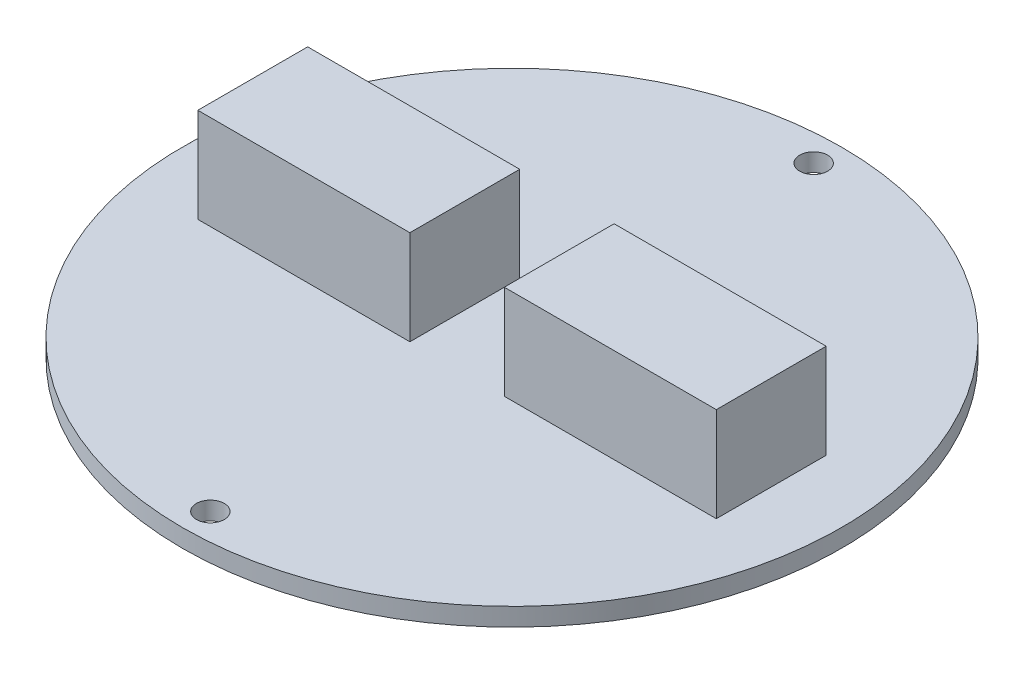
ISO-10303-21;
HEADER;
FILE_DESCRIPTION(('STEP AP214'),'2;1');
FILE_NAME('part.step','',(''),(''),'','','');
FILE_SCHEMA(('AUTOMOTIVE_DESIGN { 1 0 10303 214 1 1 1 1 }'));
ENDSEC;
DATA;
#1=APPLICATION_CONTEXT('core data for automotive mechanical design processes');
#2=APPLICATION_PROTOCOL_DEFINITION('international standard','automotive_design',2000,#1);
#3=PRODUCT_CONTEXT('',#1,'mechanical');
#4=PRODUCT('Part','Part','',(#3));
#5=PRODUCT_RELATED_PRODUCT_CATEGORY('part','',(#4));
#6=PRODUCT_DEFINITION_FORMATION('','',#4);
#7=PRODUCT_DEFINITION_CONTEXT('part definition',#1,'design');
#8=PRODUCT_DEFINITION('design','',#6,#7);
#9=PRODUCT_DEFINITION_SHAPE('','',#8);
#10=(LENGTH_UNIT() NAMED_UNIT(*) SI_UNIT(.MILLI.,.METRE.));
#11=(NAMED_UNIT(*) PLANE_ANGLE_UNIT() SI_UNIT($,.RADIAN.));
#12=(NAMED_UNIT(*) SI_UNIT($,.STERADIAN.) SOLID_ANGLE_UNIT());
#13=UNCERTAINTY_MEASURE_WITH_UNIT(LENGTH_MEASURE(1.E-05),#10,'distance_accuracy_value','');
#14=(GEOMETRIC_REPRESENTATION_CONTEXT(3) GLOBAL_UNCERTAINTY_ASSIGNED_CONTEXT((#13)) GLOBAL_UNIT_ASSIGNED_CONTEXT((#10,
#11,#12)) REPRESENTATION_CONTEXT('',''));
#15=CARTESIAN_POINT('',(0.,0.,0.));
#16=DIRECTION('',(0.,0.,1.));
#17=DIRECTION('',(1.,0.,0.));
#18=AXIS2_PLACEMENT_3D('',#15,#16,#17);
#19=CARTESIAN_POINT('',(0.,1.64,0.));
#20=DIRECTION('',(0.,1.,0.));
#21=DIRECTION('',(0.,0.,1.));
#22=AXIS2_PLACEMENT_3D('',#19,#20,#21);
#23=PLANE('',#22);
#24=DIRECTION('',(-1.,0.,0.));
#25=VECTOR('',#24,1.);
#26=CARTESIAN_POINT('',(-23.6,1.64,-5.));
#27=LINE('',#26,#25);
#28=CARTESIAN_POINT('',(-4.296,1.64,-5.));
#29=VERTEX_POINT('',#28);
#30=CARTESIAN_POINT('',(-23.6,1.64,-5.));
#31=VERTEX_POINT('',#30);
#32=EDGE_CURVE('E126',#29,#31,#27,.T.);
#33=ORIENTED_EDGE('',*,*,#32,.F.);
#34=DIRECTION('',(0.,0.,-1.));
#35=VECTOR('',#34,1.);
#36=CARTESIAN_POINT('',(-4.296,1.64,5.));
#37=LINE('',#36,#35);
#38=CARTESIAN_POINT('',(-4.296,1.64,5.));
#39=VERTEX_POINT('',#38);
#40=EDGE_CURVE('E123',#39,#29,#37,.T.);
#41=ORIENTED_EDGE('',*,*,#40,.F.);
#42=DIRECTION('',(1.,0.,0.));
#43=VECTOR('',#42,1.);
#44=CARTESIAN_POINT('',(-23.6,1.64,5.));
#45=LINE('',#44,#43);
#46=CARTESIAN_POINT('',(-23.6,1.64,5.));
#47=VERTEX_POINT('',#46);
#48=EDGE_CURVE('E135',#47,#39,#45,.T.);
#49=ORIENTED_EDGE('',*,*,#48,.F.);
#50=DIRECTION('',(0.,0.,1.));
#51=VECTOR('',#50,1.);
#52=CARTESIAN_POINT('',(-23.6,1.64,5.));
#53=LINE('',#52,#51);
#54=EDGE_CURVE('E143',#31,#47,#53,.T.);
#55=ORIENTED_EDGE('',*,*,#54,.F.);
#56=EDGE_LOOP('',(#33,#41,#49,#55));
#57=FACE_BOUND('',#56,.T.);
#58=CARTESIAN_POINT('',(0.,1.64,27.46));
#59=DIRECTION('',(0.,1.,0.));
#60=DIRECTION('',(0.,0.,1.));
#61=AXIS2_PLACEMENT_3D('',#58,#59,#60);
#62=CIRCLE('',#61,1.27);
#63=CARTESIAN_POINT('',(0.,1.64,28.73));
#64=VERTEX_POINT('',#63);
#65=EDGE_CURVE('E154',#64,#64,#62,.T.);
#66=ORIENTED_EDGE('',*,*,#65,.F.);
#67=EDGE_LOOP('',(#66));
#68=FACE_BOUND('',#67,.T.);
#69=CARTESIAN_POINT('',(0.,1.64,-27.46));
#70=DIRECTION('',(0.,1.,0.));
#71=DIRECTION('',(0.,0.,1.));
#72=AXIS2_PLACEMENT_3D('',#69,#70,#71);
#73=CIRCLE('',#72,1.27);
#74=CARTESIAN_POINT('',(0.,1.64,-26.19));
#75=VERTEX_POINT('',#74);
#76=EDGE_CURVE('E158',#75,#75,#73,.T.);
#77=ORIENTED_EDGE('',*,*,#76,.F.);
#78=EDGE_LOOP('',(#77));
#79=FACE_BOUND('',#78,.T.);
#80=CARTESIAN_POINT('',(0.,1.64,0.));
#81=DIRECTION('',(0.,1.,0.));
#82=DIRECTION('',(0.,0.,1.));
#83=AXIS2_PLACEMENT_3D('',#80,#81,#82);
#84=CIRCLE('',#83,30.);
#85=CARTESIAN_POINT('',(0.,1.64,30.));
#86=VERTEX_POINT('',#85);
#87=EDGE_CURVE('E11',#86,#86,#84,.T.);
#88=ORIENTED_EDGE('',*,*,#87,.T.);
#89=EDGE_LOOP('',(#88));
#90=FACE_BOUND('',#89,.T.);
#91=DIRECTION('',(-1.,0.,0.));
#92=VECTOR('',#91,1.);
#93=CARTESIAN_POINT('',(4.296,1.64,-5.));
#94=LINE('',#93,#92);
#95=CARTESIAN_POINT('',(23.6,1.64,-5.));
#96=VERTEX_POINT('',#95);
#97=CARTESIAN_POINT('',(4.296,1.64,-5.));
#98=VERTEX_POINT('',#97);
#99=EDGE_CURVE('E176',#96,#98,#94,.T.);
#100=ORIENTED_EDGE('',*,*,#99,.F.);
#101=DIRECTION('',(0.,0.,-1.));
#102=VECTOR('',#101,1.);
#103=CARTESIAN_POINT('',(23.6,1.64,5.));
#104=LINE('',#103,#102);
#105=CARTESIAN_POINT('',(23.6,1.64,5.));
#106=VERTEX_POINT('',#105);
#107=EDGE_CURVE('E121',#106,#96,#104,.T.);
#108=ORIENTED_EDGE('',*,*,#107,.F.);
#109=DIRECTION('',(1.,0.,0.));
#110=VECTOR('',#109,1.);
#111=CARTESIAN_POINT('',(4.296,1.64,5.));
#112=LINE('',#111,#110);
#113=CARTESIAN_POINT('',(4.296,1.64,5.));
#114=VERTEX_POINT('',#113);
#115=EDGE_CURVE('E117',#114,#106,#112,.T.);
#116=ORIENTED_EDGE('',*,*,#115,.F.);
#117=DIRECTION('',(0.,0.,1.));
#118=VECTOR('',#117,1.);
#119=CARTESIAN_POINT('',(4.296,1.64,5.));
#120=LINE('',#119,#118);
#121=EDGE_CURVE('E178',#98,#114,#120,.T.);
#122=ORIENTED_EDGE('',*,*,#121,.F.);
#123=EDGE_LOOP('',(#100,#108,#116,#122));
#124=FACE_BOUND('',#123,.T.);
#125=ADVANCED_FACE('F32',(#57,#68,#79,#90,#124),#23,.T.);
#126=CARTESIAN_POINT('',(0.,1.64,0.));
#127=DIRECTION('',(0.,-1.,0.));
#128=DIRECTION('',(0.,0.,-1.));
#129=AXIS2_PLACEMENT_3D('',#126,#127,#128);
#130=CYLINDRICAL_SURFACE('',#129,30.);
#131=ORIENTED_EDGE('',*,*,#87,.F.);
#132=EDGE_LOOP('',(#131));
#133=FACE_BOUND('',#132,.T.);
#134=CARTESIAN_POINT('',(0.,0.,0.));
#135=DIRECTION('',(0.,1.,0.));
#136=DIRECTION('',(0.,0.,1.));
#137=AXIS2_PLACEMENT_3D('',#134,#135,#136);
#138=CIRCLE('',#137,30.);
#139=CARTESIAN_POINT('',(0.,0.,30.));
#140=VERTEX_POINT('',#139);
#141=EDGE_CURVE('E36',#140,#140,#138,.T.);
#142=ORIENTED_EDGE('',*,*,#141,.T.);
#143=EDGE_LOOP('',(#142));
#144=FACE_BOUND('',#143,.T.);
#145=ADVANCED_FACE('F34',(#133,#144),#130,.T.);
#146=CARTESIAN_POINT('',(0.,0.,0.));
#147=DIRECTION('',(0.,1.,0.));
#148=DIRECTION('',(0.,0.,1.));
#149=AXIS2_PLACEMENT_3D('',#146,#147,#148);
#150=PLANE('',#149);
#151=CARTESIAN_POINT('',(0.,0.,27.46));
#152=DIRECTION('',(0.,1.,0.));
#153=DIRECTION('',(0.,0.,1.));
#154=AXIS2_PLACEMENT_3D('',#151,#152,#153);
#155=CIRCLE('',#154,1.27);
#156=CARTESIAN_POINT('',(0.,0.,28.73));
#157=VERTEX_POINT('',#156);
#158=EDGE_CURVE('E155',#157,#157,#155,.T.);
#159=ORIENTED_EDGE('',*,*,#158,.T.);
#160=EDGE_LOOP('',(#159));
#161=FACE_BOUND('',#160,.T.);
#162=CARTESIAN_POINT('',(0.,0.,-27.46));
#163=DIRECTION('',(0.,1.,0.));
#164=DIRECTION('',(0.,0.,1.));
#165=AXIS2_PLACEMENT_3D('',#162,#163,#164);
#166=CIRCLE('',#165,1.27);
#167=CARTESIAN_POINT('',(0.,0.,-26.19));
#168=VERTEX_POINT('',#167);
#169=EDGE_CURVE('E161',#168,#168,#166,.T.);
#170=ORIENTED_EDGE('',*,*,#169,.T.);
#171=EDGE_LOOP('',(#170));
#172=FACE_BOUND('',#171,.T.);
#173=ORIENTED_EDGE('',*,*,#141,.F.);
#174=EDGE_LOOP('',(#173));
#175=FACE_BOUND('',#174,.T.);
#176=ADVANCED_FACE('F227',(#161,#172,#175),#150,.F.);
#177=CARTESIAN_POINT('',(0.,0.,-27.46));
#178=DIRECTION('',(0.,1.,0.));
#179=DIRECTION('',(0.,0.,1.));
#180=AXIS2_PLACEMENT_3D('',#177,#178,#179);
#181=CYLINDRICAL_SURFACE('',#180,1.27);
#182=ORIENTED_EDGE('',*,*,#169,.F.);
#183=EDGE_LOOP('',(#182));
#184=FACE_BOUND('',#183,.T.);
#185=ORIENTED_EDGE('',*,*,#76,.T.);
#186=EDGE_LOOP('',(#185));
#187=FACE_BOUND('',#186,.T.);
#188=ADVANCED_FACE('F167',(#184,#187),#181,.F.);
#189=CARTESIAN_POINT('',(0.,0.,27.46));
#190=DIRECTION('',(0.,1.,0.));
#191=DIRECTION('',(0.,0.,1.));
#192=AXIS2_PLACEMENT_3D('',#189,#190,#191);
#193=CYLINDRICAL_SURFACE('',#192,1.27);
#194=ORIENTED_EDGE('',*,*,#158,.F.);
#195=EDGE_LOOP('',(#194));
#196=FACE_BOUND('',#195,.T.);
#197=ORIENTED_EDGE('',*,*,#65,.T.);
#198=EDGE_LOOP('',(#197));
#199=FACE_BOUND('',#198,.T.);
#200=ADVANCED_FACE('F221',(#196,#199),#193,.F.);
#201=CARTESIAN_POINT('',(-4.296,10.24,5.));
#202=DIRECTION('',(-1.,0.,0.));
#203=DIRECTION('',(0.,0.,1.));
#204=AXIS2_PLACEMENT_3D('',#201,#202,#203);
#205=PLANE('',#204);
#206=ORIENTED_EDGE('',*,*,#40,.T.);
#207=DIRECTION('',(0.,-1.,0.));
#208=VECTOR('',#207,1.);
#209=CARTESIAN_POINT('',(-4.296,10.24,-5.));
#210=LINE('',#209,#208);
#211=CARTESIAN_POINT('',(-4.296,10.24,-5.));
#212=VERTEX_POINT('',#211);
#213=EDGE_CURVE('E152',#212,#29,#210,.T.);
#214=ORIENTED_EDGE('',*,*,#213,.F.);
#215=DIRECTION('',(0.,0.,-1.));
#216=VECTOR('',#215,1.);
#217=CARTESIAN_POINT('',(-4.296,10.24,5.));
#218=LINE('',#217,#216);
#219=CARTESIAN_POINT('',(-4.296,10.24,5.));
#220=VERTEX_POINT('',#219);
#221=EDGE_CURVE('E131',#220,#212,#218,.T.);
#222=ORIENTED_EDGE('',*,*,#221,.F.);
#223=DIRECTION('',(0.,-1.,0.));
#224=VECTOR('',#223,1.);
#225=CARTESIAN_POINT('',(-4.296,10.24,5.));
#226=LINE('',#225,#224);
#227=EDGE_CURVE('E140',#220,#39,#226,.T.);
#228=ORIENTED_EDGE('',*,*,#227,.T.);
#229=EDGE_LOOP('',(#206,#214,#222,#228));
#230=FACE_BOUND('',#229,.T.);
#231=ADVANCED_FACE('F217',(#230),#205,.F.);
#232=CARTESIAN_POINT('',(-23.6,10.24,-5.));
#233=DIRECTION('',(0.,0.,1.));
#234=DIRECTION('',(1.,0.,0.));
#235=AXIS2_PLACEMENT_3D('',#232,#233,#234);
#236=PLANE('',#235);
#237=ORIENTED_EDGE('',*,*,#32,.T.);
#238=DIRECTION('',(0.,-1.,0.));
#239=VECTOR('',#238,1.);
#240=CARTESIAN_POINT('',(-23.6,10.24,-5.));
#241=LINE('',#240,#239);
#242=CARTESIAN_POINT('',(-23.6,10.24,-5.));
#243=VERTEX_POINT('',#242);
#244=EDGE_CURVE('E149',#243,#31,#241,.T.);
#245=ORIENTED_EDGE('',*,*,#244,.F.);
#246=DIRECTION('',(-1.,0.,0.));
#247=VECTOR('',#246,1.);
#248=CARTESIAN_POINT('',(-23.6,10.24,-5.));
#249=LINE('',#248,#247);
#250=EDGE_CURVE('E134',#212,#243,#249,.T.);
#251=ORIENTED_EDGE('',*,*,#250,.F.);
#252=ORIENTED_EDGE('',*,*,#213,.T.);
#253=EDGE_LOOP('',(#237,#245,#251,#252));
#254=FACE_BOUND('',#253,.T.);
#255=ADVANCED_FACE('F213',(#254),#236,.F.);
#256=CARTESIAN_POINT('',(-23.6,10.24,5.));
#257=DIRECTION('',(1.,0.,0.));
#258=DIRECTION('',(0.,0.,-1.));
#259=AXIS2_PLACEMENT_3D('',#256,#257,#258);
#260=PLANE('',#259);
#261=ORIENTED_EDGE('',*,*,#54,.T.);
#262=DIRECTION('',(0.,-1.,0.));
#263=VECTOR('',#262,1.);
#264=CARTESIAN_POINT('',(-23.6,10.24,5.));
#265=LINE('',#264,#263);
#266=CARTESIAN_POINT('',(-23.6,10.24,5.));
#267=VERTEX_POINT('',#266);
#268=EDGE_CURVE('E55',#267,#47,#265,.T.);
#269=ORIENTED_EDGE('',*,*,#268,.F.);
#270=DIRECTION('',(0.,0.,1.));
#271=VECTOR('',#270,1.);
#272=CARTESIAN_POINT('',(-23.6,10.24,5.));
#273=LINE('',#272,#271);
#274=EDGE_CURVE('E137',#243,#267,#273,.T.);
#275=ORIENTED_EDGE('',*,*,#274,.F.);
#276=ORIENTED_EDGE('',*,*,#244,.T.);
#277=EDGE_LOOP('',(#261,#269,#275,#276));
#278=FACE_BOUND('',#277,.T.);
#279=ADVANCED_FACE('F210',(#278),#260,.F.);
#280=CARTESIAN_POINT('',(-23.6,10.24,5.));
#281=DIRECTION('',(0.,0.,-1.));
#282=DIRECTION('',(-1.,0.,0.));
#283=AXIS2_PLACEMENT_3D('',#280,#281,#282);
#284=PLANE('',#283);
#285=ORIENTED_EDGE('',*,*,#48,.T.);
#286=ORIENTED_EDGE('',*,*,#227,.F.);
#287=DIRECTION('',(1.,0.,0.));
#288=VECTOR('',#287,1.);
#289=CARTESIAN_POINT('',(-23.6,10.24,5.));
#290=LINE('',#289,#288);
#291=EDGE_CURVE('E139',#267,#220,#290,.T.);
#292=ORIENTED_EDGE('',*,*,#291,.F.);
#293=ORIENTED_EDGE('',*,*,#268,.T.);
#294=EDGE_LOOP('',(#285,#286,#292,#293));
#295=FACE_BOUND('',#294,.T.);
#296=ADVANCED_FACE('F206',(#295),#284,.F.);
#297=CARTESIAN_POINT('',(-4.296,10.24,-5.));
#298=DIRECTION('',(0.,-1.,0.));
#299=DIRECTION('',(0.,0.,-1.));
#300=AXIS2_PLACEMENT_3D('',#297,#298,#299);
#301=PLANE('',#300);
#302=ORIENTED_EDGE('',*,*,#221,.T.);
#303=ORIENTED_EDGE('',*,*,#250,.T.);
#304=ORIENTED_EDGE('',*,*,#274,.T.);
#305=ORIENTED_EDGE('',*,*,#291,.T.);
#306=EDGE_LOOP('',(#302,#303,#304,#305));
#307=FACE_BOUND('',#306,.T.);
#308=ADVANCED_FACE('F203',(#307),#301,.F.);
#309=CARTESIAN_POINT('',(23.6,10.24,5.));
#310=DIRECTION('',(-1.,0.,0.));
#311=DIRECTION('',(0.,0.,1.));
#312=AXIS2_PLACEMENT_3D('',#309,#310,#311);
#313=PLANE('',#312);
#314=ORIENTED_EDGE('',*,*,#107,.T.);
#315=DIRECTION('',(0.,-1.,0.));
#316=VECTOR('',#315,1.);
#317=CARTESIAN_POINT('',(23.6,10.24,-5.));
#318=LINE('',#317,#316);
#319=CARTESIAN_POINT('',(23.6,10.24,-5.));
#320=VERTEX_POINT('',#319);
#321=EDGE_CURVE('E102',#320,#96,#318,.T.);
#322=ORIENTED_EDGE('',*,*,#321,.F.);
#323=DIRECTION('',(0.,0.,-1.));
#324=VECTOR('',#323,1.);
#325=CARTESIAN_POINT('',(23.6,10.24,5.));
#326=LINE('',#325,#324);
#327=CARTESIAN_POINT('',(23.6,10.24,5.));
#328=VERTEX_POINT('',#327);
#329=EDGE_CURVE('E109',#328,#320,#326,.T.);
#330=ORIENTED_EDGE('',*,*,#329,.F.);
#331=DIRECTION('',(0.,-1.,0.));
#332=VECTOR('',#331,1.);
#333=CARTESIAN_POINT('',(23.6,10.24,5.));
#334=LINE('',#333,#332);
#335=EDGE_CURVE('E185',#328,#106,#334,.T.);
#336=ORIENTED_EDGE('',*,*,#335,.T.);
#337=EDGE_LOOP('',(#314,#322,#330,#336));
#338=FACE_BOUND('',#337,.T.);
#339=ADVANCED_FACE('F119',(#338),#313,.F.);
#340=CARTESIAN_POINT('',(4.296,10.24,-5.));
#341=DIRECTION('',(0.,0.,1.));
#342=DIRECTION('',(1.,0.,0.));
#343=AXIS2_PLACEMENT_3D('',#340,#341,#342);
#344=PLANE('',#343);
#345=ORIENTED_EDGE('',*,*,#99,.T.);
#346=DIRECTION('',(0.,-1.,0.));
#347=VECTOR('',#346,1.);
#348=CARTESIAN_POINT('',(4.296,10.24,-5.));
#349=LINE('',#348,#347);
#350=CARTESIAN_POINT('',(4.296,10.24,-5.));
#351=VERTEX_POINT('',#350);
#352=EDGE_CURVE('E105',#351,#98,#349,.T.);
#353=ORIENTED_EDGE('',*,*,#352,.F.);
#354=DIRECTION('',(-1.,0.,0.));
#355=VECTOR('',#354,1.);
#356=CARTESIAN_POINT('',(4.296,10.24,-5.));
#357=LINE('',#356,#355);
#358=EDGE_CURVE('E98',#320,#351,#357,.T.);
#359=ORIENTED_EDGE('',*,*,#358,.F.);
#360=ORIENTED_EDGE('',*,*,#321,.T.);
#361=EDGE_LOOP('',(#345,#353,#359,#360));
#362=FACE_BOUND('',#361,.T.);
#363=ADVANCED_FACE('F100',(#362),#344,.F.);
#364=CARTESIAN_POINT('',(4.296,10.24,5.));
#365=DIRECTION('',(1.,0.,0.));
#366=DIRECTION('',(0.,0.,-1.));
#367=AXIS2_PLACEMENT_3D('',#364,#365,#366);
#368=PLANE('',#367);
#369=ORIENTED_EDGE('',*,*,#121,.T.);
#370=DIRECTION('',(0.,-1.,0.));
#371=VECTOR('',#370,1.);
#372=CARTESIAN_POINT('',(4.296,10.24,5.));
#373=LINE('',#372,#371);
#374=CARTESIAN_POINT('',(4.296,10.24,5.));
#375=VERTEX_POINT('',#374);
#376=EDGE_CURVE('E47',#375,#114,#373,.T.);
#377=ORIENTED_EDGE('',*,*,#376,.F.);
#378=DIRECTION('',(0.,0.,1.));
#379=VECTOR('',#378,1.);
#380=CARTESIAN_POINT('',(4.296,10.24,5.));
#381=LINE('',#380,#379);
#382=EDGE_CURVE('E108',#351,#375,#381,.T.);
#383=ORIENTED_EDGE('',*,*,#382,.F.);
#384=ORIENTED_EDGE('',*,*,#352,.T.);
#385=EDGE_LOOP('',(#369,#377,#383,#384));
#386=FACE_BOUND('',#385,.T.);
#387=ADVANCED_FACE('F188',(#386),#368,.F.);
#388=CARTESIAN_POINT('',(4.296,10.24,5.));
#389=DIRECTION('',(0.,0.,-1.));
#390=DIRECTION('',(-1.,0.,0.));
#391=AXIS2_PLACEMENT_3D('',#388,#389,#390);
#392=PLANE('',#391);
#393=ORIENTED_EDGE('',*,*,#115,.T.);
#394=ORIENTED_EDGE('',*,*,#335,.F.);
#395=DIRECTION('',(1.,0.,0.));
#396=VECTOR('',#395,1.);
#397=CARTESIAN_POINT('',(4.296,10.24,5.));
#398=LINE('',#397,#396);
#399=EDGE_CURVE('E113',#375,#328,#398,.T.);
#400=ORIENTED_EDGE('',*,*,#399,.F.);
#401=ORIENTED_EDGE('',*,*,#376,.T.);
#402=EDGE_LOOP('',(#393,#394,#400,#401));
#403=FACE_BOUND('',#402,.T.);
#404=ADVANCED_FACE('F189',(#403),#392,.F.);
#405=CARTESIAN_POINT('',(23.6,10.24,-5.));
#406=DIRECTION('',(0.,-1.,0.));
#407=DIRECTION('',(0.,0.,-1.));
#408=AXIS2_PLACEMENT_3D('',#405,#406,#407);
#409=PLANE('',#408);
#410=ORIENTED_EDGE('',*,*,#329,.T.);
#411=ORIENTED_EDGE('',*,*,#358,.T.);
#412=ORIENTED_EDGE('',*,*,#382,.T.);
#413=ORIENTED_EDGE('',*,*,#399,.T.);
#414=EDGE_LOOP('',(#410,#411,#412,#413));
#415=FACE_BOUND('',#414,.T.);
#416=ADVANCED_FACE('F112',(#415),#409,.F.);
#417=CLOSED_SHELL('',(#125,#145,#176,#188,#200,#231,#255,#279,#296,#308,#339,#363,#387,#404,#416));
#418=MANIFOLD_SOLID_BREP('B2',#417);
#419=ADVANCED_BREP_SHAPE_REPRESENTATION('',(#18,#418),#14);
#420=SHAPE_DEFINITION_REPRESENTATION(#9,#419);
ENDSEC;
END-ISO-10303-21;
